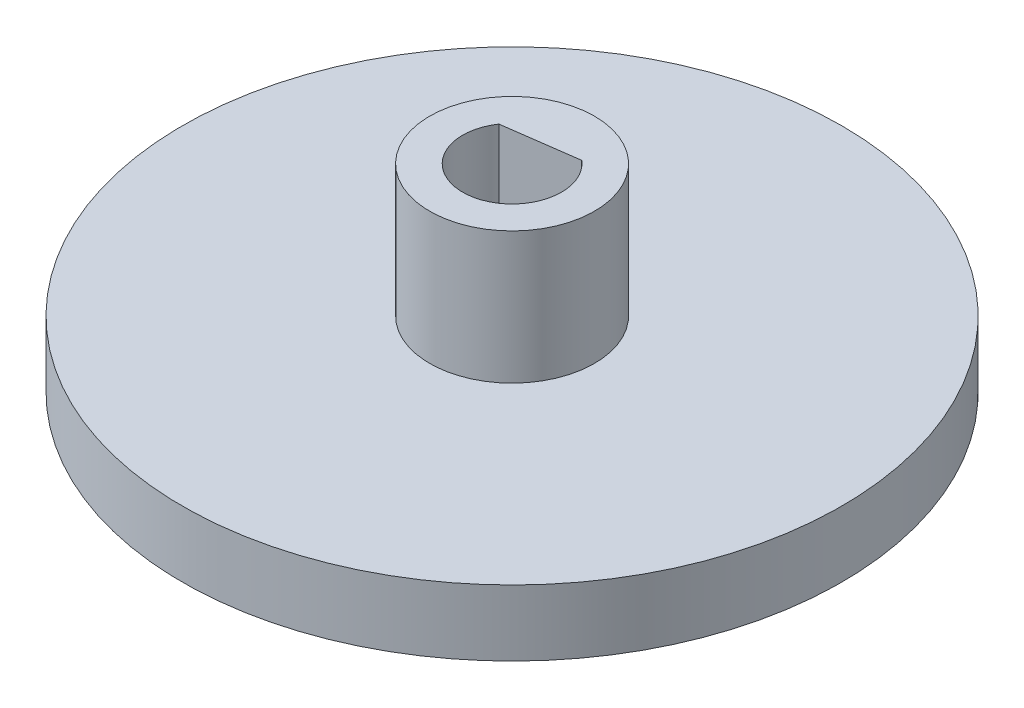
ISO-10303-21;
HEADER;
FILE_DESCRIPTION(('STEP AP214'),'2;1');
FILE_NAME('part.step','',(''),(''),'','','');
FILE_SCHEMA(('AUTOMOTIVE_DESIGN { 1 0 10303 214 1 1 1 1 }'));
ENDSEC;
DATA;
#1=APPLICATION_CONTEXT('core data for automotive mechanical design processes');
#2=APPLICATION_PROTOCOL_DEFINITION('international standard','automotive_design',2000,#1);
#3=PRODUCT_CONTEXT('',#1,'mechanical');
#4=PRODUCT('Part','Part','',(#3));
#5=PRODUCT_RELATED_PRODUCT_CATEGORY('part','',(#4));
#6=PRODUCT_DEFINITION_FORMATION('','',#4);
#7=PRODUCT_DEFINITION_CONTEXT('part definition',#1,'design');
#8=PRODUCT_DEFINITION('design','',#6,#7);
#9=PRODUCT_DEFINITION_SHAPE('','',#8);
#10=(LENGTH_UNIT() NAMED_UNIT(*) SI_UNIT(.MILLI.,.METRE.));
#11=(NAMED_UNIT(*) PLANE_ANGLE_UNIT() SI_UNIT($,.RADIAN.));
#12=(NAMED_UNIT(*) SI_UNIT($,.STERADIAN.) SOLID_ANGLE_UNIT());
#13=UNCERTAINTY_MEASURE_WITH_UNIT(LENGTH_MEASURE(1.E-05),#10,'distance_accuracy_value','');
#14=(GEOMETRIC_REPRESENTATION_CONTEXT(3) GLOBAL_UNCERTAINTY_ASSIGNED_CONTEXT((#13)) GLOBAL_UNIT_ASSIGNED_CONTEXT((#10,
#11,#12)) REPRESENTATION_CONTEXT('',''));
#15=CARTESIAN_POINT('',(0.,0.,0.));
#16=DIRECTION('',(0.,0.,1.));
#17=DIRECTION('',(1.,0.,0.));
#18=AXIS2_PLACEMENT_3D('',#15,#16,#17);
#19=CARTESIAN_POINT('',(0.,10.,0.));
#20=DIRECTION('',(0.,1.,0.));
#21=DIRECTION('',(0.,0.,1.));
#22=AXIS2_PLACEMENT_3D('',#19,#20,#21);
#23=PLANE('',#22);
#24=CARTESIAN_POINT('',(0.,10.,0.));
#25=DIRECTION('',(0.,1.,0.));
#26=DIRECTION('',(0.,0.,1.));
#27=AXIS2_PLACEMENT_3D('',#24,#25,#26);
#28=CIRCLE('',#27,1.4999483478744);
#29=CARTESIAN_POINT('',(0.968768207565023,10.,-1.1451345799959));
#30=VERTEX_POINT('',#29);
#31=CARTESIAN_POINT('',(-1.24237832859475,10.,-0.840441035962218));
#32=VERTEX_POINT('',#31);
#33=EDGE_CURVE('E69',#30,#32,#28,.F.);
#34=ORIENTED_EDGE('',*,*,#33,.T.);
#35=DIRECTION('',(0.99063883966287,0.,-0.136508935060685));
#36=VECTOR('',#35,1.);
#37=CARTESIAN_POINT('',(-0.136805060514863,10.,-0.992787807979058));
#38=LINE('',#37,#36);
#39=EDGE_CURVE('E50',#32,#30,#38,.T.);
#40=ORIENTED_EDGE('',*,*,#39,.T.);
#41=EDGE_LOOP('',(#34,#40));
#42=FACE_BOUND('',#41,.T.);
#43=CARTESIAN_POINT('',(0.,10.,0.));
#44=DIRECTION('',(0.,-1.,0.));
#45=DIRECTION('',(0.,0.,-1.));
#46=AXIS2_PLACEMENT_3D('',#43,#44,#45);
#47=CIRCLE('',#46,2.5000000000002);
#48=CARTESIAN_POINT('',(0.,10.,-2.5000000000002));
#49=VERTEX_POINT('',#48);
#50=EDGE_CURVE('E89',#49,#49,#47,.T.);
#51=ORIENTED_EDGE('',*,*,#50,.F.);
#52=EDGE_LOOP('',(#51));
#53=FACE_BOUND('',#52,.T.);
#54=ADVANCED_FACE('F34',(#42,#53),#23,.T.);
#55=CARTESIAN_POINT('',(0.,10.,0.));
#56=DIRECTION('',(0.,-1.,0.));
#57=DIRECTION('',(0.,0.,-1.));
#58=AXIS2_PLACEMENT_3D('',#55,#56,#57);
#59=CYLINDRICAL_SURFACE('',#58,2.5000000000002);
#60=CARTESIAN_POINT('',(0.,4.,0.));
#61=DIRECTION('',(0.,-1.,0.));
#62=DIRECTION('',(0.,0.,-1.));
#63=AXIS2_PLACEMENT_3D('',#60,#61,#62);
#64=CIRCLE('',#63,2.5000000000002);
#65=CARTESIAN_POINT('',(0.,4.,-2.5000000000002));
#66=VERTEX_POINT('',#65);
#67=EDGE_CURVE('E75',#66,#66,#64,.T.);
#68=ORIENTED_EDGE('',*,*,#67,.T.);
#69=EDGE_LOOP('',(#68));
#70=FACE_BOUND('',#69,.T.);
#71=CARTESIAN_POINT('',(0.,0.,0.));
#72=DIRECTION('',(0.,1.,0.));
#73=DIRECTION('',(0.,0.,1.));
#74=AXIS2_PLACEMENT_3D('',#71,#72,#73);
#75=CIRCLE('',#74,2.5000000000002);
#76=CARTESIAN_POINT('',(0.,0.,2.5000000000002));
#77=VERTEX_POINT('',#76);
#78=EDGE_CURVE('E65',#77,#77,#75,.T.);
#79=ORIENTED_EDGE('',*,*,#78,.T.);
#80=EDGE_LOOP('',(#79));
#81=FACE_BOUND('',#80,.T.);
#82=ADVANCED_FACE('F100',(#70,#81),#59,.T.);
#83=CARTESIAN_POINT('',(0.,10.,0.));
#84=DIRECTION('',(0.,-1.,0.));
#85=DIRECTION('',(0.,0.,-1.));
#86=AXIS2_PLACEMENT_3D('',#83,#84,#85);
#87=CYLINDRICAL_SURFACE('',#86,1.4999483478744);
#88=CARTESIAN_POINT('',(0.,0.,0.));
#89=DIRECTION('',(0.,1.,0.));
#90=DIRECTION('',(0.,0.,1.));
#91=AXIS2_PLACEMENT_3D('',#88,#89,#90);
#92=CIRCLE('',#91,1.4999483478744);
#93=CARTESIAN_POINT('',(0.968768207565023,0.,-1.1451345799959));
#94=VERTEX_POINT('',#93);
#95=CARTESIAN_POINT('',(-1.24237832859475,0.,-0.840441035962218));
#96=VERTEX_POINT('',#95);
#97=EDGE_CURVE('E66',#94,#96,#92,.F.);
#98=ORIENTED_EDGE('',*,*,#97,.T.);
#99=DIRECTION('',(0.,-1.,0.));
#100=VECTOR('',#99,1.);
#101=CARTESIAN_POINT('',(-1.24237832859475,10.,-0.840441035962218));
#102=LINE('',#101,#100);
#103=EDGE_CURVE('E11',#32,#96,#102,.T.);
#104=ORIENTED_EDGE('',*,*,#103,.F.);
#105=ORIENTED_EDGE('',*,*,#33,.F.);
#106=DIRECTION('',(0.,-1.,0.));
#107=VECTOR('',#106,1.);
#108=CARTESIAN_POINT('',(0.968768207565023,10.,-1.1451345799959));
#109=LINE('',#108,#107);
#110=EDGE_CURVE('E43',#30,#94,#109,.T.);
#111=ORIENTED_EDGE('',*,*,#110,.T.);
#112=EDGE_LOOP('',(#98,#104,#105,#111));
#113=FACE_BOUND('',#112,.T.);
#114=ADVANCED_FACE('F36',(#113),#87,.F.);
#115=CARTESIAN_POINT('',(-0.136805060514863,10.,-0.992787807979058));
#116=DIRECTION('',(-0.136508935060685,0.,-0.99063883966287));
#117=DIRECTION('',(-0.99063883966287,0.,0.136508935060685));
#118=AXIS2_PLACEMENT_3D('',#115,#116,#117);
#119=PLANE('',#118);
#120=DIRECTION('',(0.99063883966287,0.,-0.136508935060685));
#121=VECTOR('',#120,1.);
#122=CARTESIAN_POINT('',(-0.136805060514863,0.,-0.992787807979058));
#123=LINE('',#122,#121);
#124=EDGE_CURVE('E58',#96,#94,#123,.T.);
#125=ORIENTED_EDGE('',*,*,#124,.T.);
#126=ORIENTED_EDGE('',*,*,#110,.F.);
#127=ORIENTED_EDGE('',*,*,#39,.F.);
#128=ORIENTED_EDGE('',*,*,#103,.T.);
#129=EDGE_LOOP('',(#125,#126,#127,#128));
#130=FACE_BOUND('',#129,.T.);
#131=ADVANCED_FACE('F61',(#130),#119,.F.);
#132=CARTESIAN_POINT('',(0.,0.,0.));
#133=DIRECTION('',(0.,1.,0.));
#134=DIRECTION('',(0.,0.,1.));
#135=AXIS2_PLACEMENT_3D('',#132,#133,#134);
#136=PLANE('',#135);
#137=ORIENTED_EDGE('',*,*,#97,.F.);
#138=ORIENTED_EDGE('',*,*,#124,.F.);
#139=EDGE_LOOP('',(#137,#138));
#140=FACE_BOUND('',#139,.T.);
#141=ORIENTED_EDGE('',*,*,#78,.F.);
#142=EDGE_LOOP('',(#141));
#143=FACE_BOUND('',#142,.T.);
#144=ADVANCED_FACE('F70',(#140,#143),#136,.F.);
#145=CARTESIAN_POINT('',(0.,6.,0.));
#146=DIRECTION('',(0.,1.,0.));
#147=DIRECTION('',(0.,0.,1.));
#148=AXIS2_PLACEMENT_3D('',#145,#146,#147);
#149=CYLINDRICAL_SURFACE('',#148,10.0000000000002);
#150=CARTESIAN_POINT('',(0.,6.,0.));
#151=DIRECTION('',(0.,-1.,0.));
#152=DIRECTION('',(0.,0.,-1.));
#153=AXIS2_PLACEMENT_3D('',#150,#151,#152);
#154=CIRCLE('',#153,10.0000000000002);
#155=CARTESIAN_POINT('',(0.,6.,-10.0000000000002));
#156=VERTEX_POINT('',#155);
#157=EDGE_CURVE('E86',#156,#156,#154,.T.);
#158=ORIENTED_EDGE('',*,*,#157,.T.);
#159=EDGE_LOOP('',(#158));
#160=FACE_BOUND('',#159,.T.);
#161=CARTESIAN_POINT('',(0.,4.,0.));
#162=DIRECTION('',(0.,-1.,0.));
#163=DIRECTION('',(0.,0.,-1.));
#164=AXIS2_PLACEMENT_3D('',#161,#162,#163);
#165=CIRCLE('',#164,10.0000000000002);
#166=CARTESIAN_POINT('',(0.,4.,-10.0000000000002));
#167=VERTEX_POINT('',#166);
#168=EDGE_CURVE('E72',#167,#167,#165,.T.);
#169=ORIENTED_EDGE('',*,*,#168,.F.);
#170=EDGE_LOOP('',(#169));
#171=FACE_BOUND('',#170,.T.);
#172=ADVANCED_FACE('F111',(#160,#171),#149,.T.);
#173=CARTESIAN_POINT('',(0.,4.,0.));
#174=DIRECTION('',(0.,-1.,0.));
#175=DIRECTION('',(0.,0.,-1.));
#176=AXIS2_PLACEMENT_3D('',#173,#174,#175);
#177=PLANE('',#176);
#178=ORIENTED_EDGE('',*,*,#168,.T.);
#179=EDGE_LOOP('',(#178));
#180=FACE_BOUND('',#179,.T.);
#181=ORIENTED_EDGE('',*,*,#67,.F.);
#182=EDGE_LOOP('',(#181));
#183=FACE_BOUND('',#182,.T.);
#184=ADVANCED_FACE('F142',(#180,#183),#177,.T.);
#185=CARTESIAN_POINT('',(0.,6.,0.));
#186=DIRECTION('',(0.,-1.,0.));
#187=DIRECTION('',(0.,0.,-1.));
#188=AXIS2_PLACEMENT_3D('',#185,#186,#187);
#189=PLANE('',#188);
#190=CARTESIAN_POINT('',(0.,6.,0.));
#191=DIRECTION('',(0.,-1.,0.));
#192=DIRECTION('',(0.,0.,-1.));
#193=AXIS2_PLACEMENT_3D('',#190,#191,#192);
#194=CIRCLE('',#193,2.5000000000002);
#195=CARTESIAN_POINT('',(0.,6.,-2.5000000000002));
#196=VERTEX_POINT('',#195);
#197=EDGE_CURVE('E90',#196,#196,#194,.T.);
#198=ORIENTED_EDGE('',*,*,#197,.T.);
#199=EDGE_LOOP('',(#198));
#200=FACE_BOUND('',#199,.T.);
#201=ORIENTED_EDGE('',*,*,#157,.F.);
#202=EDGE_LOOP('',(#201));
#203=FACE_BOUND('',#202,.T.);
#204=ADVANCED_FACE('F146',(#200,#203),#189,.F.);
#205=CARTESIAN_POINT('',(0.,10.,0.));
#206=DIRECTION('',(0.,-1.,0.));
#207=DIRECTION('',(0.,0.,-1.));
#208=AXIS2_PLACEMENT_3D('',#205,#206,#207);
#209=CYLINDRICAL_SURFACE('',#208,2.5000000000002);
#210=ORIENTED_EDGE('',*,*,#50,.T.);
#211=EDGE_LOOP('',(#210));
#212=FACE_BOUND('',#211,.T.);
#213=ORIENTED_EDGE('',*,*,#197,.F.);
#214=EDGE_LOOP('',(#213));
#215=FACE_BOUND('',#214,.T.);
#216=ADVANCED_FACE('F96',(#212,#215),#209,.T.);
#217=CLOSED_SHELL('',(#54,#82,#114,#131,#144,#172,#184,#204,#216));
#218=MANIFOLD_SOLID_BREP('B2',#217);
#219=ADVANCED_BREP_SHAPE_REPRESENTATION('',(#18,#218),#14);
#220=SHAPE_DEFINITION_REPRESENTATION(#9,#219);
ENDSEC;
END-ISO-10303-21;
